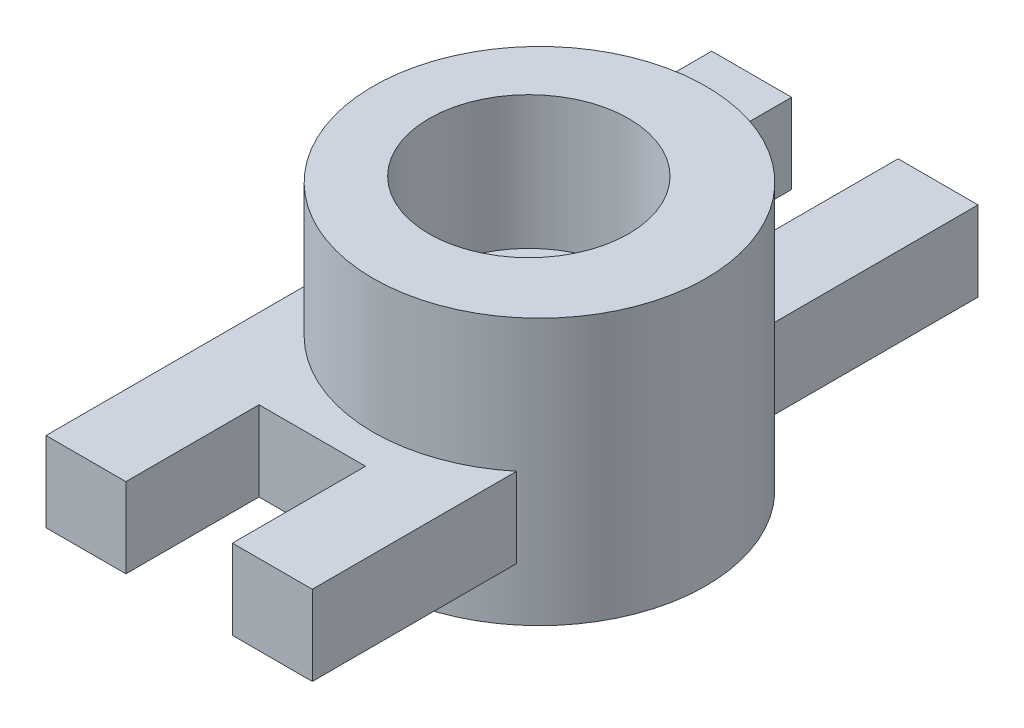
ISO-10303-21;
HEADER;
FILE_DESCRIPTION(('STEP AP214'),'2;1');
FILE_NAME('part.step','',(''),(''),'','','');
FILE_SCHEMA(('AUTOMOTIVE_DESIGN { 1 0 10303 214 1 1 1 1 }'));
ENDSEC;
DATA;
#1=APPLICATION_CONTEXT('core data for automotive mechanical design processes');
#2=APPLICATION_PROTOCOL_DEFINITION('international standard','automotive_design',2000,#1);
#3=PRODUCT_CONTEXT('',#1,'mechanical');
#4=PRODUCT('Part','Part','',(#3));
#5=PRODUCT_RELATED_PRODUCT_CATEGORY('part','',(#4));
#6=PRODUCT_DEFINITION_FORMATION('','',#4);
#7=PRODUCT_DEFINITION_CONTEXT('part definition',#1,'design');
#8=PRODUCT_DEFINITION('design','',#6,#7);
#9=PRODUCT_DEFINITION_SHAPE('','',#8);
#10=(LENGTH_UNIT() NAMED_UNIT(*) SI_UNIT(.MILLI.,.METRE.));
#11=(NAMED_UNIT(*) PLANE_ANGLE_UNIT() SI_UNIT($,.RADIAN.));
#12=(NAMED_UNIT(*) SI_UNIT($,.STERADIAN.) SOLID_ANGLE_UNIT());
#13=UNCERTAINTY_MEASURE_WITH_UNIT(LENGTH_MEASURE(1.E-05),#10,'distance_accuracy_value','');
#14=(GEOMETRIC_REPRESENTATION_CONTEXT(3) GLOBAL_UNCERTAINTY_ASSIGNED_CONTEXT((#13)) GLOBAL_UNIT_ASSIGNED_CONTEXT((#10,
#11,#12)) REPRESENTATION_CONTEXT('',''));
#15=CARTESIAN_POINT('',(0.,0.,0.));
#16=DIRECTION('',(0.,0.,1.));
#17=DIRECTION('',(1.,0.,0.));
#18=AXIS2_PLACEMENT_3D('',#15,#16,#17);
#19=CARTESIAN_POINT('',(-40.,5.81818181818181,-65.0909090909091));
#20=DIRECTION('',(0.,0.,-1.));
#21=DIRECTION('',(-1.,0.,0.));
#22=AXIS2_PLACEMENT_3D('',#19,#20,#21);
#23=PLANE('',#22);
#24=DIRECTION('',(0.,-1.,0.));
#25=VECTOR('',#24,1.);
#26=CARTESIAN_POINT('',(-12.,5.81818181818181,-65.0909090909091));
#27=LINE('',#26,#25);
#28=CARTESIAN_POINT('',(-12.,5.81818181818181,-65.0909090909091));
#29=VERTEX_POINT('',#28);
#30=CARTESIAN_POINT('',(-12.,-6.18181818181819,-65.0909090909091));
#31=VERTEX_POINT('',#30);
#32=EDGE_CURVE('E171',#29,#31,#27,.T.);
#33=ORIENTED_EDGE('',*,*,#32,.F.);
#34=DIRECTION('',(1.,0.,0.));
#35=VECTOR('',#34,1.);
#36=CARTESIAN_POINT('',(-40.,5.81818181818181,-65.0909090909091));
#37=LINE('',#36,#35);
#38=CARTESIAN_POINT('',(0.,5.81818181818181,-65.0909090909091));
#39=VERTEX_POINT('',#38);
#40=EDGE_CURVE('E298',#29,#39,#37,.T.);
#41=ORIENTED_EDGE('',*,*,#40,.T.);
#42=DIRECTION('',(0.,1.,0.));
#43=VECTOR('',#42,1.);
#44=CARTESIAN_POINT('',(0.,5.81818181818181,-65.0909090909091));
#45=LINE('',#44,#43);
#46=CARTESIAN_POINT('',(0.,-6.18181818181819,-65.0909090909091));
#47=VERTEX_POINT('',#46);
#48=EDGE_CURVE('E280',#47,#39,#45,.T.);
#49=ORIENTED_EDGE('',*,*,#48,.F.);
#50=DIRECTION('',(1.,0.,0.));
#51=VECTOR('',#50,1.);
#52=CARTESIAN_POINT('',(-40.,-6.18181818181819,-65.0909090909091));
#53=LINE('',#52,#51);
#54=EDGE_CURVE('E301',#31,#47,#53,.T.);
#55=ORIENTED_EDGE('',*,*,#54,.F.);
#56=EDGE_LOOP('',(#33,#41,#49,#55));
#57=FACE_BOUND('',#56,.T.);
#58=ADVANCED_FACE('F39',(#57),#23,.T.);
#59=CARTESIAN_POINT('',(-40.,5.81818181818181,34.9090909090909));
#60=DIRECTION('',(0.,0.,1.));
#61=DIRECTION('',(1.,0.,0.));
#62=AXIS2_PLACEMENT_3D('',#59,#60,#61);
#63=PLANE('',#62);
#64=DIRECTION('',(0.,-1.,0.));
#65=VECTOR('',#64,1.);
#66=CARTESIAN_POINT('',(-28.,5.81818181818181,34.9090909090909));
#67=LINE('',#66,#65);
#68=CARTESIAN_POINT('',(-28.,5.81818181818181,34.9090909090909));
#69=VERTEX_POINT('',#68);
#70=CARTESIAN_POINT('',(-28.,-6.18181818181819,34.9090909090909));
#71=VERTEX_POINT('',#70);
#72=EDGE_CURVE('E189',#69,#71,#67,.T.);
#73=ORIENTED_EDGE('',*,*,#72,.F.);
#74=DIRECTION('',(1.,0.,0.));
#75=VECTOR('',#74,1.);
#76=CARTESIAN_POINT('',(-40.,5.81818181818181,34.9090909090909));
#77=LINE('',#76,#75);
#78=CARTESIAN_POINT('',(-40.,5.81818181818181,34.9090909090909));
#79=VERTEX_POINT('',#78);
#80=EDGE_CURVE('E288',#79,#69,#77,.T.);
#81=ORIENTED_EDGE('',*,*,#80,.F.);
#82=DIRECTION('',(0.,-1.,0.));
#83=VECTOR('',#82,1.);
#84=CARTESIAN_POINT('',(-40.,5.81818181818181,34.9090909090909));
#85=LINE('',#84,#83);
#86=CARTESIAN_POINT('',(-40.,-6.18181818181819,34.9090909090909));
#87=VERTEX_POINT('',#86);
#88=EDGE_CURVE('E252',#79,#87,#85,.T.);
#89=ORIENTED_EDGE('',*,*,#88,.T.);
#90=DIRECTION('',(1.,0.,0.));
#91=VECTOR('',#90,1.);
#92=CARTESIAN_POINT('',(-40.,-6.18181818181819,34.9090909090909));
#93=LINE('',#92,#91);
#94=EDGE_CURVE('E302',#87,#71,#93,.T.);
#95=ORIENTED_EDGE('',*,*,#94,.T.);
#96=EDGE_LOOP('',(#73,#81,#89,#95));
#97=FACE_BOUND('',#96,.T.);
#98=ADVANCED_FACE('F342',(#97),#63,.T.);
#99=CARTESIAN_POINT('',(-40.,-6.18181818181819,34.9090909090909));
#100=DIRECTION('',(0.,-1.,0.));
#101=DIRECTION('',(0.,0.,-1.));
#102=AXIS2_PLACEMENT_3D('',#99,#100,#101);
#103=PLANE('',#102);
#104=DIRECTION('',(0.,0.,1.));
#105=VECTOR('',#104,1.);
#106=CARTESIAN_POINT('',(-28.,-6.18181818181819,14.9090909090909));
#107=LINE('',#106,#105);
#108=CARTESIAN_POINT('',(-28.,-6.18181818181819,14.9090909090909));
#109=VERTEX_POINT('',#108);
#110=EDGE_CURVE('E206',#109,#71,#107,.T.);
#111=ORIENTED_EDGE('',*,*,#110,.T.);
#112=ORIENTED_EDGE('',*,*,#94,.F.);
#113=DIRECTION('',(0.,0.,-1.));
#114=VECTOR('',#113,1.);
#115=CARTESIAN_POINT('',(-40.,-6.18181818181819,34.9090909090909));
#116=LINE('',#115,#114);
#117=CARTESIAN_POINT('',(-40.,-6.18181818181818,-8.55078627379439));
#118=VERTEX_POINT('',#117);
#119=EDGE_CURVE('E258',#87,#118,#116,.T.);
#120=ORIENTED_EDGE('',*,*,#119,.T.);
#121=CARTESIAN_POINT('',(-15.8706238469152,-6.18181818181818,-15.0909090909091));
#122=DIRECTION('',(0.,-1.,0.));
#123=DIRECTION('',(0.,0.,-1.));
#124=AXIS2_PLACEMENT_3D('',#121,#122,#123);
#125=CIRCLE('',#124,25.);
#126=CARTESIAN_POINT('',(0.,-6.18181818181818,4.22549064376522));
#127=VERTEX_POINT('',#126);
#128=EDGE_CURVE('E240',#118,#127,#125,.F.);
#129=ORIENTED_EDGE('',*,*,#128,.T.);
#130=DIRECTION('',(0.,0.,-1.));
#131=VECTOR('',#130,1.);
#132=CARTESIAN_POINT('',(0.,-6.18181818181819,34.9090909090909));
#133=LINE('',#132,#131);
#134=CARTESIAN_POINT('',(0.,-6.18181818181819,34.9090909090909));
#135=VERTEX_POINT('',#134);
#136=EDGE_CURVE('E276',#135,#127,#133,.T.);
#137=ORIENTED_EDGE('',*,*,#136,.F.);
#138=CARTESIAN_POINT('',(-12.,-6.18181818181819,34.9090909090909));
#139=VERTEX_POINT('',#138);
#140=EDGE_CURVE('E271',#139,#135,#93,.T.);
#141=ORIENTED_EDGE('',*,*,#140,.F.);
#142=DIRECTION('',(0.,0.,1.));
#143=VECTOR('',#142,1.);
#144=CARTESIAN_POINT('',(-12.,-6.18181818181819,14.9090909090909));
#145=LINE('',#144,#143);
#146=CARTESIAN_POINT('',(-12.,-6.18181818181819,14.9090909090909));
#147=VERTEX_POINT('',#146);
#148=EDGE_CURVE('E199',#147,#139,#145,.T.);
#149=ORIENTED_EDGE('',*,*,#148,.F.);
#150=DIRECTION('',(1.,0.,0.));
#151=VECTOR('',#150,1.);
#152=CARTESIAN_POINT('',(-28.,-6.18181818181819,14.9090909090909));
#153=LINE('',#152,#151);
#154=EDGE_CURVE('E186',#109,#147,#153,.T.);
#155=ORIENTED_EDGE('',*,*,#154,.F.);
#156=EDGE_LOOP('',(#111,#112,#120,#129,#137,#141,#149,#155));
#157=FACE_BOUND('',#156,.T.);
#158=ADVANCED_FACE('F324',(#157),#103,.T.);
#159=CARTESIAN_POINT('',(-40.,0.,0.));
#160=DIRECTION('',(1.,0.,0.));
#161=DIRECTION('',(0.,0.,-1.));
#162=AXIS2_PLACEMENT_3D('',#159,#160,#161);
#163=PLANE('',#162);
#164=DIRECTION('',(0.,-1.,0.));
#165=VECTOR('',#164,1.);
#166=CARTESIAN_POINT('',(-40.,25.8181818181818,-8.55078627379439));
#167=LINE('',#166,#165);
#168=CARTESIAN_POINT('',(-40.,5.81818181818181,-8.55078627379439));
#169=VERTEX_POINT('',#168);
#170=EDGE_CURVE('E248',#118,#169,#167,.F.);
#171=ORIENTED_EDGE('',*,*,#170,.F.);
#172=ORIENTED_EDGE('',*,*,#119,.F.);
#173=ORIENTED_EDGE('',*,*,#88,.F.);
#174=DIRECTION('',(0.,0.,1.));
#175=VECTOR('',#174,1.);
#176=CARTESIAN_POINT('',(-40.,5.81818181818181,34.9090909090909));
#177=LINE('',#176,#175);
#178=EDGE_CURVE('E266',#169,#79,#177,.T.);
#179=ORIENTED_EDGE('',*,*,#178,.F.);
#180=EDGE_LOOP('',(#171,#172,#173,#179));
#181=FACE_BOUND('',#180,.T.);
#182=ADVANCED_FACE('F341',(#181),#163,.F.);
#183=CARTESIAN_POINT('',(0.,0.,0.));
#184=DIRECTION('',(1.,0.,0.));
#185=DIRECTION('',(0.,0.,-1.));
#186=AXIS2_PLACEMENT_3D('',#183,#184,#185);
#187=PLANE('',#186);
#188=ORIENTED_EDGE('',*,*,#136,.T.);
#189=DIRECTION('',(0.,-1.,0.));
#190=VECTOR('',#189,1.);
#191=CARTESIAN_POINT('',(0.,25.8181818181818,4.22549064376522));
#192=LINE('',#191,#190);
#193=CARTESIAN_POINT('',(0.,5.81818181818181,4.22549064376522));
#194=VERTEX_POINT('',#193);
#195=EDGE_CURVE('E308',#127,#194,#192,.F.);
#196=ORIENTED_EDGE('',*,*,#195,.T.);
#197=DIRECTION('',(0.,0.,1.));
#198=VECTOR('',#197,1.);
#199=CARTESIAN_POINT('',(0.,5.81818181818181,34.9090909090909));
#200=LINE('',#199,#198);
#201=CARTESIAN_POINT('',(0.,5.81818181818181,34.9090909090909));
#202=VERTEX_POINT('',#201);
#203=EDGE_CURVE('E284',#194,#202,#200,.T.);
#204=ORIENTED_EDGE('',*,*,#203,.T.);
#205=DIRECTION('',(0.,-1.,0.));
#206=VECTOR('',#205,1.);
#207=CARTESIAN_POINT('',(0.,5.81818181818181,34.9090909090909));
#208=LINE('',#207,#206);
#209=EDGE_CURVE('E250',#202,#135,#208,.T.);
#210=ORIENTED_EDGE('',*,*,#209,.T.);
#211=EDGE_LOOP('',(#188,#196,#204,#210));
#212=FACE_BOUND('',#211,.T.);
#213=ADVANCED_FACE('F395',(#212),#187,.T.);
#214=DIRECTION('',(0.,1.,0.));
#215=VECTOR('',#214,1.);
#216=CARTESIAN_POINT('',(-12.,5.81818181818181,34.9090909090909));
#217=LINE('',#216,#215);
#218=CARTESIAN_POINT('',(-12.,5.81818181818181,34.9090909090909));
#219=VERTEX_POINT('',#218);
#220=EDGE_CURVE('E200',#139,#219,#217,.T.);
#221=ORIENTED_EDGE('',*,*,#220,.F.);
#222=ORIENTED_EDGE('',*,*,#140,.T.);
#223=ORIENTED_EDGE('',*,*,#209,.F.);
#224=EDGE_CURVE('E293',#219,#202,#77,.T.);
#225=ORIENTED_EDGE('',*,*,#224,.F.);
#226=EDGE_LOOP('',(#221,#222,#223,#225));
#227=FACE_BOUND('',#226,.T.);
#228=ADVANCED_FACE('F41',(#227),#63,.T.);
#229=CARTESIAN_POINT('',(-40.,5.81818181818181,34.9090909090909));
#230=DIRECTION('',(0.,1.,0.));
#231=DIRECTION('',(0.,0.,1.));
#232=AXIS2_PLACEMENT_3D('',#229,#230,#231);
#233=PLANE('',#232);
#234=DIRECTION('',(0.,0.,1.));
#235=VECTOR('',#234,1.);
#236=CARTESIAN_POINT('',(-28.,5.81818181818181,14.9090909090909));
#237=LINE('',#236,#235);
#238=CARTESIAN_POINT('',(-28.,5.81818181818181,14.9090909090909));
#239=VERTEX_POINT('',#238);
#240=EDGE_CURVE('E211',#239,#69,#237,.T.);
#241=ORIENTED_EDGE('',*,*,#240,.F.);
#242=DIRECTION('',(-1.,0.,0.));
#243=VECTOR('',#242,1.);
#244=CARTESIAN_POINT('',(-28.,5.81818181818181,14.9090909090909));
#245=LINE('',#244,#243);
#246=CARTESIAN_POINT('',(-12.,5.81818181818181,14.9090909090909));
#247=VERTEX_POINT('',#246);
#248=EDGE_CURVE('E192',#247,#239,#245,.T.);
#249=ORIENTED_EDGE('',*,*,#248,.F.);
#250=DIRECTION('',(0.,0.,1.));
#251=VECTOR('',#250,1.);
#252=CARTESIAN_POINT('',(-12.,5.81818181818181,14.9090909090909));
#253=LINE('',#252,#251);
#254=EDGE_CURVE('E214',#247,#219,#253,.T.);
#255=ORIENTED_EDGE('',*,*,#254,.T.);
#256=ORIENTED_EDGE('',*,*,#224,.T.);
#257=ORIENTED_EDGE('',*,*,#203,.F.);
#258=CARTESIAN_POINT('',(-15.8706238469152,5.81818181818181,-15.0909090909091));
#259=DIRECTION('',(0.,1.,0.));
#260=DIRECTION('',(0.,0.,1.));
#261=AXIS2_PLACEMENT_3D('',#258,#259,#260);
#262=CIRCLE('',#261,25.);
#263=EDGE_CURVE('E245',#194,#169,#262,.F.);
#264=ORIENTED_EDGE('',*,*,#263,.T.);
#265=ORIENTED_EDGE('',*,*,#178,.T.);
#266=ORIENTED_EDGE('',*,*,#80,.T.);
#267=EDGE_LOOP('',(#241,#249,#255,#256,#257,#264,#265,#266));
#268=FACE_BOUND('',#267,.T.);
#269=ADVANCED_FACE('F332',(#268),#233,.T.);
#270=CARTESIAN_POINT('',(-17.4706238469152,25.8181818181818,-15.0909090909091));
#271=DIRECTION('',(0.,-1.,0.));
#272=DIRECTION('',(0.,0.,-1.));
#273=AXIS2_PLACEMENT_3D('',#270,#271,#272);
#274=CYLINDRICAL_SURFACE('',#273,15.);
#275=CARTESIAN_POINT('',(-17.4706238469152,5.81818181818181,-15.0909090909091));
#276=DIRECTION('',(0.,1.,0.));
#277=DIRECTION('',(0.,0.,1.));
#278=AXIS2_PLACEMENT_3D('',#275,#276,#277);
#279=CIRCLE('',#278,15.);
#280=CARTESIAN_POINT('',(-17.4706238469152,5.81818181818181,-0.0909090909090946));
#281=VERTEX_POINT('',#280);
#282=EDGE_CURVE('E11',#281,#281,#279,.F.);
#283=ORIENTED_EDGE('',*,*,#282,.T.);
#284=EDGE_LOOP('',(#283));
#285=FACE_BOUND('',#284,.T.);
#286=CARTESIAN_POINT('',(-17.4706238469152,25.8181818181818,-15.0909090909091));
#287=DIRECTION('',(0.,1.,0.));
#288=DIRECTION('',(0.,0.,1.));
#289=AXIS2_PLACEMENT_3D('',#286,#287,#288);
#290=CIRCLE('',#289,15.);
#291=CARTESIAN_POINT('',(-17.4706238469152,25.8181818181818,-0.0909090909090946));
#292=VERTEX_POINT('',#291);
#293=EDGE_CURVE('E220',#292,#292,#290,.T.);
#294=ORIENTED_EDGE('',*,*,#293,.T.);
#295=EDGE_LOOP('',(#294));
#296=FACE_BOUND('',#295,.T.);
#297=ADVANCED_FACE('F336',(#285,#296),#274,.F.);
#298=CARTESIAN_POINT('',(-15.8706238469152,25.8181818181818,-15.0909090909091));
#299=DIRECTION('',(0.,-1.,0.));
#300=DIRECTION('',(0.,0.,-1.));
#301=AXIS2_PLACEMENT_3D('',#298,#299,#300);
#302=CYLINDRICAL_SURFACE('',#301,25.);
#303=CARTESIAN_POINT('',(-15.8706238469152,25.8181818181818,-15.0909090909091));
#304=DIRECTION('',(0.,1.,0.));
#305=DIRECTION('',(0.,0.,1.));
#306=AXIS2_PLACEMENT_3D('',#303,#304,#305);
#307=CIRCLE('',#306,25.);
#308=CARTESIAN_POINT('',(-15.8706238469152,25.8181818181818,9.90909090909091));
#309=VERTEX_POINT('',#308);
#310=EDGE_CURVE('E228',#309,#309,#307,.T.);
#311=ORIENTED_EDGE('',*,*,#310,.F.);
#312=EDGE_LOOP('',(#311));
#313=FACE_BOUND('',#312,.T.);
#314=CARTESIAN_POINT('',(-15.8706238469152,-14.1818181818182,-15.0909090909091));
#315=DIRECTION('',(0.,1.,0.));
#316=DIRECTION('',(0.,0.,1.));
#317=AXIS2_PLACEMENT_3D('',#314,#315,#316);
#318=CIRCLE('',#317,25.);
#319=CARTESIAN_POINT('',(-15.8706238469152,-14.1818181818182,9.90909090909091));
#320=VERTEX_POINT('',#319);
#321=EDGE_CURVE('E224',#320,#320,#318,.T.);
#322=ORIENTED_EDGE('',*,*,#321,.T.);
#323=EDGE_LOOP('',(#322));
#324=FACE_BOUND('',#323,.T.);
#325=CARTESIAN_POINT('',(-40.,5.81818181818181,-21.6310319080238));
#326=VERTEX_POINT('',#325);
#327=CARTESIAN_POINT('',(0.,5.81818181818181,-34.4073088255834));
#328=VERTEX_POINT('',#327);
#329=EDGE_CURVE('E239',#326,#328,#262,.F.);
#330=ORIENTED_EDGE('',*,*,#329,.F.);
#331=DIRECTION('',(0.,-1.,0.));
#332=VECTOR('',#331,1.);
#333=CARTESIAN_POINT('',(-40.,25.8181818181818,-21.6310319080238));
#334=LINE('',#333,#332);
#335=CARTESIAN_POINT('',(-40.,-6.18181818181818,-21.6310319080238));
#336=VERTEX_POINT('',#335);
#337=EDGE_CURVE('E244',#326,#336,#334,.T.);
#338=ORIENTED_EDGE('',*,*,#337,.T.);
#339=CARTESIAN_POINT('',(0.,-6.18181818181819,-34.4073088255834));
#340=VERTEX_POINT('',#339);
#341=EDGE_CURVE('E232',#340,#336,#125,.F.);
#342=ORIENTED_EDGE('',*,*,#341,.F.);
#343=DIRECTION('',(0.,-1.,0.));
#344=VECTOR('',#343,1.);
#345=CARTESIAN_POINT('',(0.,25.8181818181818,-34.4073088255834));
#346=LINE('',#345,#344);
#347=EDGE_CURVE('E292',#328,#340,#346,.T.);
#348=ORIENTED_EDGE('',*,*,#347,.F.);
#349=EDGE_LOOP('',(#330,#338,#342,#348));
#350=FACE_BOUND('',#349,.T.);
#351=ORIENTED_EDGE('',*,*,#128,.F.);
#352=ORIENTED_EDGE('',*,*,#170,.T.);
#353=ORIENTED_EDGE('',*,*,#263,.F.);
#354=ORIENTED_EDGE('',*,*,#195,.F.);
#355=EDGE_LOOP('',(#351,#352,#353,#354));
#356=FACE_BOUND('',#355,.T.);
#357=ADVANCED_FACE('F416',(#313,#324,#350,#356),#302,.T.);
#358=CARTESIAN_POINT('',(-15.8706238469152,25.8181818181818,-15.0909090909091));
#359=DIRECTION('',(0.,1.,0.));
#360=DIRECTION('',(0.,0.,1.));
#361=AXIS2_PLACEMENT_3D('',#358,#359,#360);
#362=PLANE('',#361);
#363=ORIENTED_EDGE('',*,*,#310,.T.);
#364=EDGE_LOOP('',(#363));
#365=FACE_BOUND('',#364,.T.);
#366=ORIENTED_EDGE('',*,*,#293,.F.);
#367=EDGE_LOOP('',(#366));
#368=FACE_BOUND('',#367,.T.);
#369=ADVANCED_FACE('F418',(#365,#368),#362,.T.);
#370=CARTESIAN_POINT('',(-15.8706238469152,-14.1818181818182,-15.0909090909091));
#371=DIRECTION('',(0.,1.,0.));
#372=DIRECTION('',(0.,0.,1.));
#373=AXIS2_PLACEMENT_3D('',#370,#371,#372);
#374=PLANE('',#373);
#375=ORIENTED_EDGE('',*,*,#321,.F.);
#376=EDGE_LOOP('',(#375));
#377=FACE_BOUND('',#376,.T.);
#378=CARTESIAN_POINT('',(-17.4706238469152,-14.1818181818182,-15.0909090909091));
#379=DIRECTION('',(0.,1.,0.));
#380=DIRECTION('',(0.,0.,1.));
#381=AXIS2_PLACEMENT_3D('',#378,#379,#380);
#382=CIRCLE('',#381,15.);
#383=CARTESIAN_POINT('',(-17.4706238469152,-14.1818181818182,-0.0909090909090946));
#384=VERTEX_POINT('',#383);
#385=EDGE_CURVE('E210',#384,#384,#382,.T.);
#386=ORIENTED_EDGE('',*,*,#385,.T.);
#387=EDGE_LOOP('',(#386));
#388=FACE_BOUND('',#387,.T.);
#389=ADVANCED_FACE('F334',(#377,#388),#374,.F.);
#390=CARTESIAN_POINT('',(-17.4706238469152,-6.18181818181818,-15.0909090909091));
#391=DIRECTION('',(0.,-1.,0.));
#392=DIRECTION('',(0.,0.,-1.));
#393=AXIS2_PLACEMENT_3D('',#390,#391,#392);
#394=CIRCLE('',#393,15.);
#395=CARTESIAN_POINT('',(-17.4706238469152,-6.18181818181818,-30.0909090909091));
#396=VERTEX_POINT('',#395);
#397=EDGE_CURVE('E43',#396,#396,#394,.F.);
#398=ORIENTED_EDGE('',*,*,#397,.T.);
#399=EDGE_LOOP('',(#398));
#400=FACE_BOUND('',#399,.T.);
#401=ORIENTED_EDGE('',*,*,#385,.F.);
#402=EDGE_LOOP('',(#401));
#403=FACE_BOUND('',#402,.T.);
#404=ADVANCED_FACE('F318',(#400,#403),#274,.F.);
#405=ORIENTED_EDGE('',*,*,#397,.F.);
#406=EDGE_LOOP('',(#405));
#407=FACE_BOUND('',#406,.T.);
#408=ADVANCED_FACE('F321',(#407),#103,.T.);
#409=ORIENTED_EDGE('',*,*,#282,.F.);
#410=EDGE_LOOP('',(#409));
#411=FACE_BOUND('',#410,.T.);
#412=ADVANCED_FACE('F323',(#411),#233,.T.);
#413=DIRECTION('',(0.,1.,0.));
#414=VECTOR('',#413,1.);
#415=CARTESIAN_POINT('',(-28.,5.81818181818181,-65.0909090909091));
#416=LINE('',#415,#414);
#417=CARTESIAN_POINT('',(-28.,-6.18181818181819,-65.0909090909091));
#418=VERTEX_POINT('',#417);
#419=CARTESIAN_POINT('',(-28.,5.81818181818181,-65.0909090909091));
#420=VERTEX_POINT('',#419);
#421=EDGE_CURVE('E359',#418,#420,#416,.T.);
#422=ORIENTED_EDGE('',*,*,#421,.F.);
#423=CARTESIAN_POINT('',(-40.,-6.18181818181819,-65.0909090909091));
#424=VERTEX_POINT('',#423);
#425=EDGE_CURVE('E176',#424,#418,#53,.T.);
#426=ORIENTED_EDGE('',*,*,#425,.F.);
#427=DIRECTION('',(0.,1.,0.));
#428=VECTOR('',#427,1.);
#429=CARTESIAN_POINT('',(-40.,5.81818181818181,-65.0909090909091));
#430=LINE('',#429,#428);
#431=CARTESIAN_POINT('',(-40.,5.81818181818181,-65.0909090909091));
#432=VERTEX_POINT('',#431);
#433=EDGE_CURVE('E262',#424,#432,#430,.T.);
#434=ORIENTED_EDGE('',*,*,#433,.T.);
#435=EDGE_CURVE('E294',#432,#420,#37,.T.);
#436=ORIENTED_EDGE('',*,*,#435,.T.);
#437=EDGE_LOOP('',(#422,#426,#434,#436));
#438=FACE_BOUND('',#437,.T.);
#439=ADVANCED_FACE('F329',(#438),#23,.T.);
#440=ORIENTED_EDGE('',*,*,#337,.F.);
#441=EDGE_CURVE('E267',#432,#326,#177,.T.);
#442=ORIENTED_EDGE('',*,*,#441,.F.);
#443=ORIENTED_EDGE('',*,*,#433,.F.);
#444=EDGE_CURVE('E256',#336,#424,#116,.T.);
#445=ORIENTED_EDGE('',*,*,#444,.F.);
#446=EDGE_LOOP('',(#440,#442,#443,#445));
#447=FACE_BOUND('',#446,.T.);
#448=ADVANCED_FACE('F352',(#447),#163,.F.);
#449=EDGE_CURVE('E257',#39,#328,#200,.T.);
#450=ORIENTED_EDGE('',*,*,#449,.T.);
#451=ORIENTED_EDGE('',*,*,#347,.T.);
#452=EDGE_CURVE('E275',#340,#47,#133,.T.);
#453=ORIENTED_EDGE('',*,*,#452,.T.);
#454=ORIENTED_EDGE('',*,*,#48,.T.);
#455=EDGE_LOOP('',(#450,#451,#453,#454));
#456=FACE_BOUND('',#455,.T.);
#457=ADVANCED_FACE('F339',(#456),#187,.T.);
#458=DIRECTION('',(0.,0.,-1.));
#459=VECTOR('',#458,1.);
#460=CARTESIAN_POINT('',(-12.,-6.18181818181819,-45.0909090909091));
#461=LINE('',#460,#459);
#462=CARTESIAN_POINT('',(-12.,-6.18181818181819,-45.0909090909091));
#463=VERTEX_POINT('',#462);
#464=EDGE_CURVE('E203',#463,#31,#461,.T.);
#465=ORIENTED_EDGE('',*,*,#464,.T.);
#466=ORIENTED_EDGE('',*,*,#54,.T.);
#467=ORIENTED_EDGE('',*,*,#452,.F.);
#468=ORIENTED_EDGE('',*,*,#341,.T.);
#469=ORIENTED_EDGE('',*,*,#444,.T.);
#470=ORIENTED_EDGE('',*,*,#425,.T.);
#471=DIRECTION('',(0.,0.,-1.));
#472=VECTOR('',#471,1.);
#473=CARTESIAN_POINT('',(-28.,-6.18181818181819,-45.0909090909091));
#474=LINE('',#473,#472);
#475=CARTESIAN_POINT('',(-28.,-6.18181818181819,-45.0909090909091));
#476=VERTEX_POINT('',#475);
#477=EDGE_CURVE('E154',#476,#418,#474,.T.);
#478=ORIENTED_EDGE('',*,*,#477,.F.);
#479=DIRECTION('',(-1.,0.,0.));
#480=VECTOR('',#479,1.);
#481=CARTESIAN_POINT('',(-12.,-6.18181818181819,-45.0909090909091));
#482=LINE('',#481,#480);
#483=EDGE_CURVE('E161',#463,#476,#482,.T.);
#484=ORIENTED_EDGE('',*,*,#483,.F.);
#485=EDGE_LOOP('',(#465,#466,#467,#468,#469,#470,#478,#484));
#486=FACE_BOUND('',#485,.T.);
#487=ADVANCED_FACE('F174',(#486),#103,.T.);
#488=DIRECTION('',(0.,0.,-1.));
#489=VECTOR('',#488,1.);
#490=CARTESIAN_POINT('',(-12.,5.81818181818181,-45.0909090909091));
#491=LINE('',#490,#489);
#492=CARTESIAN_POINT('',(-12.,5.81818181818181,-45.0909090909091));
#493=VERTEX_POINT('',#492);
#494=EDGE_CURVE('E181',#493,#29,#491,.T.);
#495=ORIENTED_EDGE('',*,*,#494,.F.);
#496=DIRECTION('',(1.,0.,0.));
#497=VECTOR('',#496,1.);
#498=CARTESIAN_POINT('',(-12.,5.81818181818181,-45.0909090909091));
#499=LINE('',#498,#497);
#500=CARTESIAN_POINT('',(-28.,5.81818181818181,-45.0909090909091));
#501=VERTEX_POINT('',#500);
#502=EDGE_CURVE('E160',#501,#493,#499,.T.);
#503=ORIENTED_EDGE('',*,*,#502,.F.);
#504=DIRECTION('',(0.,0.,-1.));
#505=VECTOR('',#504,1.);
#506=CARTESIAN_POINT('',(-28.,5.81818181818181,-45.0909090909091));
#507=LINE('',#506,#505);
#508=EDGE_CURVE('E157',#501,#420,#507,.T.);
#509=ORIENTED_EDGE('',*,*,#508,.T.);
#510=ORIENTED_EDGE('',*,*,#435,.F.);
#511=ORIENTED_EDGE('',*,*,#441,.T.);
#512=ORIENTED_EDGE('',*,*,#329,.T.);
#513=ORIENTED_EDGE('',*,*,#449,.F.);
#514=ORIENTED_EDGE('',*,*,#40,.F.);
#515=EDGE_LOOP('',(#495,#503,#509,#510,#511,#512,#513,#514));
#516=FACE_BOUND('',#515,.T.);
#517=ADVANCED_FACE('F333',(#516),#233,.T.);
#518=CARTESIAN_POINT('',(-28.,5.81818181818181,14.9090909090909));
#519=DIRECTION('',(-1.,0.,0.));
#520=DIRECTION('',(0.,0.,1.));
#521=AXIS2_PLACEMENT_3D('',#518,#519,#520);
#522=PLANE('',#521);
#523=ORIENTED_EDGE('',*,*,#72,.T.);
#524=ORIENTED_EDGE('',*,*,#110,.F.);
#525=DIRECTION('',(0.,-1.,0.));
#526=VECTOR('',#525,1.);
#527=CARTESIAN_POINT('',(-28.,5.81818181818181,14.9090909090909));
#528=LINE('',#527,#526);
#529=EDGE_CURVE('E195',#239,#109,#528,.T.);
#530=ORIENTED_EDGE('',*,*,#529,.F.);
#531=ORIENTED_EDGE('',*,*,#240,.T.);
#532=EDGE_LOOP('',(#523,#524,#530,#531));
#533=FACE_BOUND('',#532,.T.);
#534=ADVANCED_FACE('F409',(#533),#522,.F.);
#535=CARTESIAN_POINT('',(-12.,5.81818181818181,14.9090909090909));
#536=DIRECTION('',(1.,0.,0.));
#537=DIRECTION('',(0.,0.,-1.));
#538=AXIS2_PLACEMENT_3D('',#535,#536,#537);
#539=PLANE('',#538);
#540=ORIENTED_EDGE('',*,*,#220,.T.);
#541=ORIENTED_EDGE('',*,*,#254,.F.);
#542=DIRECTION('',(0.,1.,0.));
#543=VECTOR('',#542,1.);
#544=CARTESIAN_POINT('',(-12.,5.81818181818181,14.9090909090909));
#545=LINE('',#544,#543);
#546=EDGE_CURVE('E64',#147,#247,#545,.T.);
#547=ORIENTED_EDGE('',*,*,#546,.F.);
#548=ORIENTED_EDGE('',*,*,#148,.T.);
#549=EDGE_LOOP('',(#540,#541,#547,#548));
#550=FACE_BOUND('',#549,.T.);
#551=ADVANCED_FACE('F403',(#550),#539,.F.);
#552=CARTESIAN_POINT('',(0.,0.,14.9090909090909));
#553=DIRECTION('',(0.,0.,-1.));
#554=DIRECTION('',(-1.,0.,0.));
#555=AXIS2_PLACEMENT_3D('',#552,#553,#554);
#556=PLANE('',#555);
#557=ORIENTED_EDGE('',*,*,#154,.T.);
#558=ORIENTED_EDGE('',*,*,#546,.T.);
#559=ORIENTED_EDGE('',*,*,#248,.T.);
#560=ORIENTED_EDGE('',*,*,#529,.T.);
#561=EDGE_LOOP('',(#557,#558,#559,#560));
#562=FACE_BOUND('',#561,.T.);
#563=ADVANCED_FACE('F405',(#562),#556,.F.);
#564=CARTESIAN_POINT('',(-12.,5.81818181818181,-45.0909090909091));
#565=DIRECTION('',(1.,0.,0.));
#566=DIRECTION('',(0.,0.,-1.));
#567=AXIS2_PLACEMENT_3D('',#564,#565,#566);
#568=PLANE('',#567);
#569=ORIENTED_EDGE('',*,*,#32,.T.);
#570=ORIENTED_EDGE('',*,*,#464,.F.);
#571=DIRECTION('',(0.,-1.,0.));
#572=VECTOR('',#571,1.);
#573=CARTESIAN_POINT('',(-12.,5.81818181818181,-45.0909090909091));
#574=LINE('',#573,#572);
#575=EDGE_CURVE('E167',#493,#463,#574,.T.);
#576=ORIENTED_EDGE('',*,*,#575,.F.);
#577=ORIENTED_EDGE('',*,*,#494,.T.);
#578=EDGE_LOOP('',(#569,#570,#576,#577));
#579=FACE_BOUND('',#578,.T.);
#580=ADVANCED_FACE('F371',(#579),#568,.F.);
#581=CARTESIAN_POINT('',(-28.,5.81818181818181,-45.0909090909091));
#582=DIRECTION('',(-1.,0.,0.));
#583=DIRECTION('',(0.,0.,1.));
#584=AXIS2_PLACEMENT_3D('',#581,#582,#583);
#585=PLANE('',#584);
#586=ORIENTED_EDGE('',*,*,#421,.T.);
#587=ORIENTED_EDGE('',*,*,#508,.F.);
#588=DIRECTION('',(0.,1.,0.));
#589=VECTOR('',#588,1.);
#590=CARTESIAN_POINT('',(-28.,5.81818181818181,-45.0909090909091));
#591=LINE('',#590,#589);
#592=EDGE_CURVE('E56',#476,#501,#591,.T.);
#593=ORIENTED_EDGE('',*,*,#592,.F.);
#594=ORIENTED_EDGE('',*,*,#477,.T.);
#595=EDGE_LOOP('',(#586,#587,#593,#594));
#596=FACE_BOUND('',#595,.T.);
#597=ADVANCED_FACE('F152',(#596),#585,.F.);
#598=CARTESIAN_POINT('',(0.,0.,-45.0909090909091));
#599=DIRECTION('',(0.,0.,1.));
#600=DIRECTION('',(1.,0.,0.));
#601=AXIS2_PLACEMENT_3D('',#598,#599,#600);
#602=PLANE('',#601);
#603=ORIENTED_EDGE('',*,*,#483,.T.);
#604=ORIENTED_EDGE('',*,*,#592,.T.);
#605=ORIENTED_EDGE('',*,*,#502,.T.);
#606=ORIENTED_EDGE('',*,*,#575,.T.);
#607=EDGE_LOOP('',(#603,#604,#605,#606));
#608=FACE_BOUND('',#607,.T.);
#609=ADVANCED_FACE('F165',(#608),#602,.F.);
#610=CLOSED_SHELL('',(#58,#98,#158,#182,#213,#228,#269,#297,#357,#369,#389,#404,#408,#412,#439,
#448,#457,#487,#517,#534,#551,#563,#580,#597,#609));
#611=MANIFOLD_SOLID_BREP('B2',#610);
#612=ADVANCED_BREP_SHAPE_REPRESENTATION('',(#18,#611),#14);
#613=SHAPE_DEFINITION_REPRESENTATION(#9,#612);
ENDSEC;
END-ISO-10303-21;
